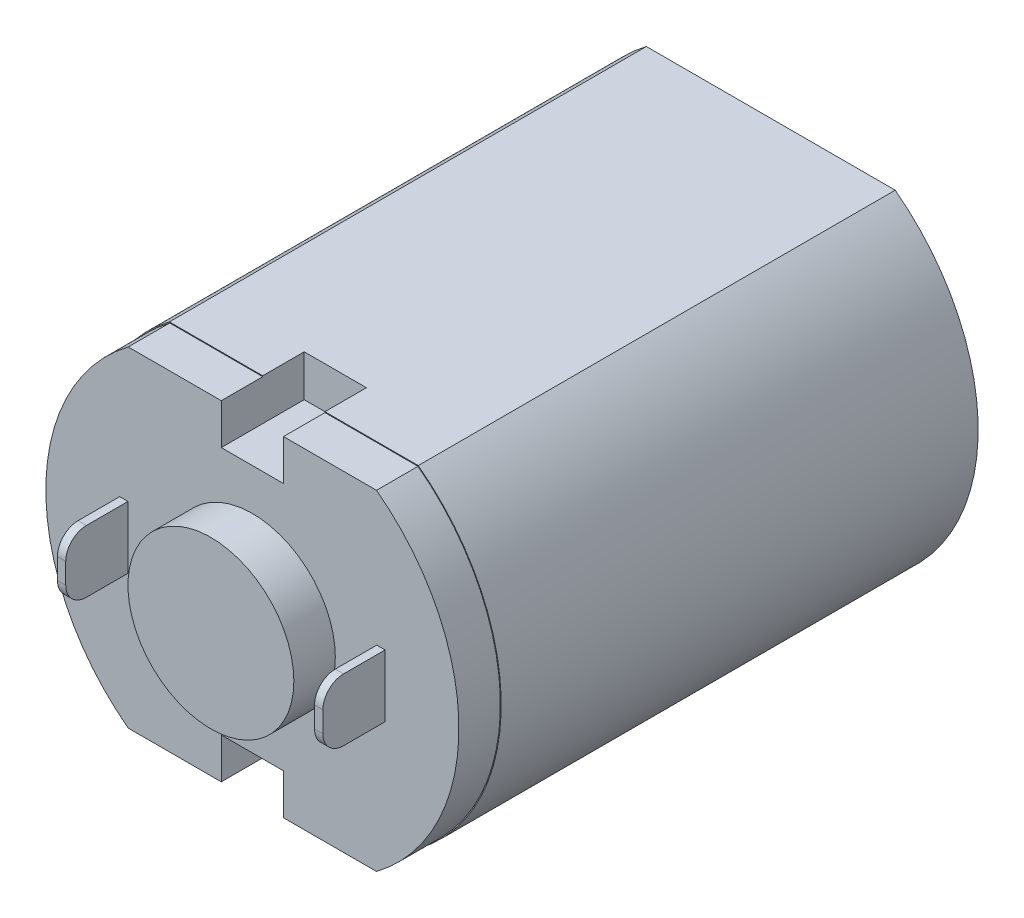
ISO-10303-21;
HEADER;
FILE_DESCRIPTION(('STEP AP214'),'2;1');
FILE_NAME('part.step','',(''),(''),'','','');
FILE_SCHEMA(('AUTOMOTIVE_DESIGN { 1 0 10303 214 1 1 1 1 }'));
ENDSEC;
DATA;
#1=APPLICATION_CONTEXT('core data for automotive mechanical design processes');
#2=APPLICATION_PROTOCOL_DEFINITION('international standard','automotive_design',2000,#1);
#3=PRODUCT_CONTEXT('',#1,'mechanical');
#4=PRODUCT('Part','Part','',(#3));
#5=PRODUCT_RELATED_PRODUCT_CATEGORY('part','',(#4));
#6=PRODUCT_DEFINITION_FORMATION('','',#4);
#7=PRODUCT_DEFINITION_CONTEXT('part definition',#1,'design');
#8=PRODUCT_DEFINITION('design','',#6,#7);
#9=PRODUCT_DEFINITION_SHAPE('','',#8);
#10=(LENGTH_UNIT() NAMED_UNIT(*) SI_UNIT(.MILLI.,.METRE.));
#11=(NAMED_UNIT(*) PLANE_ANGLE_UNIT() SI_UNIT($,.RADIAN.));
#12=(NAMED_UNIT(*) SI_UNIT($,.STERADIAN.) SOLID_ANGLE_UNIT());
#13=UNCERTAINTY_MEASURE_WITH_UNIT(LENGTH_MEASURE(1.E-05),#10,'distance_accuracy_value','');
#14=(GEOMETRIC_REPRESENTATION_CONTEXT(3) GLOBAL_UNCERTAINTY_ASSIGNED_CONTEXT((#13)) GLOBAL_UNIT_ASSIGNED_CONTEXT((#10,
#11,#12)) REPRESENTATION_CONTEXT('',''));
#15=CARTESIAN_POINT('',(0.,0.,0.));
#16=DIRECTION('',(0.,0.,1.));
#17=DIRECTION('',(1.,0.,0.));
#18=AXIS2_PLACEMENT_3D('',#15,#16,#17);
#19=CARTESIAN_POINT('',(-3.,4.,12.5));
#20=DIRECTION('',(0.,-1.,0.));
#21=DIRECTION('',(0.,0.,-1.));
#22=AXIS2_PLACEMENT_3D('',#19,#20,#21);
#23=PLANE('',#22);
#24=DIRECTION('',(1.,0.,0.));
#25=VECTOR('',#24,1.);
#26=CARTESIAN_POINT('',(0.,4.,11.5));
#27=LINE('',#26,#25);
#28=CARTESIAN_POINT('',(0.75,4.,11.5));
#29=VERTEX_POINT('',#28);
#30=CARTESIAN_POINT('',(3.,4.,11.5));
#31=VERTEX_POINT('',#30);
#32=EDGE_CURVE('E315',#29,#31,#27,.T.);
#33=ORIENTED_EDGE('',*,*,#32,.T.);
#34=DIRECTION('',(0.,0.,-1.));
#35=VECTOR('',#34,1.);
#36=CARTESIAN_POINT('',(3.,4.,12.5));
#37=LINE('',#36,#35);
#38=CARTESIAN_POINT('',(3.,4.,0.));
#39=VERTEX_POINT('',#38);
#40=EDGE_CURVE('E528',#31,#39,#37,.T.);
#41=ORIENTED_EDGE('',*,*,#40,.T.);
#42=DIRECTION('',(-1.,0.,0.));
#43=VECTOR('',#42,1.);
#44=CARTESIAN_POINT('',(-3.,4.,0.));
#45=LINE('',#44,#43);
#46=CARTESIAN_POINT('',(-3.,4.,0.));
#47=VERTEX_POINT('',#46);
#48=EDGE_CURVE('E507',#39,#47,#45,.T.);
#49=ORIENTED_EDGE('',*,*,#48,.T.);
#50=DIRECTION('',(0.,0.,-1.));
#51=VECTOR('',#50,1.);
#52=CARTESIAN_POINT('',(-3.,4.,12.5));
#53=LINE('',#52,#51);
#54=CARTESIAN_POINT('',(-3.,4.,11.5));
#55=VERTEX_POINT('',#54);
#56=EDGE_CURVE('E525',#55,#47,#53,.T.);
#57=ORIENTED_EDGE('',*,*,#56,.F.);
#58=CARTESIAN_POINT('',(-0.75,4.,11.5));
#59=VERTEX_POINT('',#58);
#60=EDGE_CURVE('E316',#55,#59,#27,.T.);
#61=ORIENTED_EDGE('',*,*,#60,.T.);
#62=DIRECTION('',(0.,0.,1.));
#63=VECTOR('',#62,1.);
#64=CARTESIAN_POINT('',(-0.75,4.,12.5));
#65=LINE('',#64,#63);
#66=CARTESIAN_POINT('',(-0.75,4.,10.5));
#67=VERTEX_POINT('',#66);
#68=EDGE_CURVE('E475',#67,#59,#65,.T.);
#69=ORIENTED_EDGE('',*,*,#68,.F.);
#70=DIRECTION('',(1.,0.,0.));
#71=VECTOR('',#70,1.);
#72=CARTESIAN_POINT('',(-3.,4.,10.5));
#73=LINE('',#72,#71);
#74=CARTESIAN_POINT('',(0.75,4.,10.5));
#75=VERTEX_POINT('',#74);
#76=EDGE_CURVE('E541',#67,#75,#73,.T.);
#77=ORIENTED_EDGE('',*,*,#76,.T.);
#78=DIRECTION('',(0.,0.,-1.));
#79=VECTOR('',#78,1.);
#80=CARTESIAN_POINT('',(0.75,4.,12.5));
#81=LINE('',#80,#79);
#82=EDGE_CURVE('E472',#29,#75,#81,.T.);
#83=ORIENTED_EDGE('',*,*,#82,.F.);
#84=EDGE_LOOP('',(#33,#41,#49,#57,#61,#69,#77,#83));
#85=FACE_BOUND('',#84,.T.);
#86=ADVANCED_FACE('F41',(#85),#23,.F.);
#87=CARTESIAN_POINT('',(-3.,-4.,12.5));
#88=DIRECTION('',(0.,1.,0.));
#89=DIRECTION('',(0.,0.,1.));
#90=AXIS2_PLACEMENT_3D('',#87,#88,#89);
#91=PLANE('',#90);
#92=DIRECTION('',(-1.,0.,0.));
#93=VECTOR('',#92,1.);
#94=CARTESIAN_POINT('',(0.,-4.,11.5));
#95=LINE('',#94,#93);
#96=CARTESIAN_POINT('',(-0.75,-4.,11.5));
#97=VERTEX_POINT('',#96);
#98=CARTESIAN_POINT('',(-3.,-4.,11.5));
#99=VERTEX_POINT('',#98);
#100=EDGE_CURVE('E269',#97,#99,#95,.T.);
#101=ORIENTED_EDGE('',*,*,#100,.T.);
#102=DIRECTION('',(0.,0.,-1.));
#103=VECTOR('',#102,1.);
#104=CARTESIAN_POINT('',(-3.,-4.,12.5));
#105=LINE('',#104,#103);
#106=CARTESIAN_POINT('',(-3.,-4.,0.));
#107=VERTEX_POINT('',#106);
#108=EDGE_CURVE('E522',#99,#107,#105,.T.);
#109=ORIENTED_EDGE('',*,*,#108,.T.);
#110=DIRECTION('',(1.,0.,0.));
#111=VECTOR('',#110,1.);
#112=CARTESIAN_POINT('',(-3.,-4.,0.));
#113=LINE('',#112,#111);
#114=CARTESIAN_POINT('',(3.,-4.,0.));
#115=VERTEX_POINT('',#114);
#116=EDGE_CURVE('E515',#107,#115,#113,.T.);
#117=ORIENTED_EDGE('',*,*,#116,.T.);
#118=DIRECTION('',(0.,0.,-1.));
#119=VECTOR('',#118,1.);
#120=CARTESIAN_POINT('',(3.,-4.,12.5));
#121=LINE('',#120,#119);
#122=CARTESIAN_POINT('',(3.,-4.,11.5));
#123=VERTEX_POINT('',#122);
#124=EDGE_CURVE('E519',#123,#115,#121,.T.);
#125=ORIENTED_EDGE('',*,*,#124,.F.);
#126=CARTESIAN_POINT('',(0.75,-4.,11.5));
#127=VERTEX_POINT('',#126);
#128=EDGE_CURVE('E308',#123,#127,#95,.T.);
#129=ORIENTED_EDGE('',*,*,#128,.T.);
#130=DIRECTION('',(0.,0.,1.));
#131=VECTOR('',#130,1.);
#132=CARTESIAN_POINT('',(0.75,-4.,12.5));
#133=LINE('',#132,#131);
#134=CARTESIAN_POINT('',(0.75,-4.,10.5));
#135=VERTEX_POINT('',#134);
#136=EDGE_CURVE('E468',#135,#127,#133,.T.);
#137=ORIENTED_EDGE('',*,*,#136,.F.);
#138=DIRECTION('',(-1.,0.,0.));
#139=VECTOR('',#138,1.);
#140=CARTESIAN_POINT('',(-3.,-4.,10.5));
#141=LINE('',#140,#139);
#142=CARTESIAN_POINT('',(-0.75,-4.,10.5));
#143=VERTEX_POINT('',#142);
#144=EDGE_CURVE('E537',#135,#143,#141,.T.);
#145=ORIENTED_EDGE('',*,*,#144,.T.);
#146=DIRECTION('',(0.,0.,-1.));
#147=VECTOR('',#146,1.);
#148=CARTESIAN_POINT('',(-0.75,-4.,12.5));
#149=LINE('',#148,#147);
#150=EDGE_CURVE('E441',#97,#143,#149,.T.);
#151=ORIENTED_EDGE('',*,*,#150,.F.);
#152=EDGE_LOOP('',(#101,#109,#117,#125,#129,#137,#145,#151));
#153=FACE_BOUND('',#152,.T.);
#154=ADVANCED_FACE('F652',(#153),#91,.F.);
#155=CARTESIAN_POINT('',(0.,0.,12.5));
#156=DIRECTION('',(0.,0.,-1.));
#157=DIRECTION('',(-1.,0.,0.));
#158=AXIS2_PLACEMENT_3D('',#155,#156,#157);
#159=CYLINDRICAL_SURFACE('',#158,5.);
#160=CARTESIAN_POINT('',(0.,0.,11.5));
#161=DIRECTION('',(0.,0.,1.));
#162=DIRECTION('',(1.,0.,0.));
#163=AXIS2_PLACEMENT_3D('',#160,#161,#162);
#164=CIRCLE('',#163,5.);
#165=EDGE_CURVE('E320',#123,#31,#164,.T.);
#166=ORIENTED_EDGE('',*,*,#165,.F.);
#167=ORIENTED_EDGE('',*,*,#124,.T.);
#168=CARTESIAN_POINT('',(0.,0.,0.));
#169=DIRECTION('',(0.,0.,1.));
#170=DIRECTION('',(1.,0.,0.));
#171=AXIS2_PLACEMENT_3D('',#168,#169,#170);
#172=CIRCLE('',#171,5.);
#173=EDGE_CURVE('E500',#115,#39,#172,.T.);
#174=ORIENTED_EDGE('',*,*,#173,.T.);
#175=ORIENTED_EDGE('',*,*,#40,.F.);
#176=EDGE_LOOP('',(#166,#167,#174,#175));
#177=FACE_BOUND('',#176,.T.);
#178=ADVANCED_FACE('F676',(#177),#159,.T.);
#179=CARTESIAN_POINT('',(0.,0.,12.5));
#180=DIRECTION('',(0.,0.,-1.));
#181=DIRECTION('',(-1.,0.,0.));
#182=AXIS2_PLACEMENT_3D('',#179,#180,#181);
#183=CYLINDRICAL_SURFACE('',#182,5.);
#184=CARTESIAN_POINT('',(0.,0.,11.5));
#185=DIRECTION('',(0.,0.,1.));
#186=DIRECTION('',(1.,0.,0.));
#187=AXIS2_PLACEMENT_3D('',#184,#185,#186);
#188=CIRCLE('',#187,5.);
#189=EDGE_CURVE('E312',#55,#99,#188,.T.);
#190=ORIENTED_EDGE('',*,*,#189,.F.);
#191=ORIENTED_EDGE('',*,*,#56,.T.);
#192=CARTESIAN_POINT('',(0.,0.,0.));
#193=DIRECTION('',(0.,0.,1.));
#194=DIRECTION('',(1.,0.,0.));
#195=AXIS2_PLACEMENT_3D('',#192,#193,#194);
#196=CIRCLE('',#195,5.);
#197=EDGE_CURVE('E511',#47,#107,#196,.T.);
#198=ORIENTED_EDGE('',*,*,#197,.T.);
#199=ORIENTED_EDGE('',*,*,#108,.F.);
#200=EDGE_LOOP('',(#190,#191,#198,#199));
#201=FACE_BOUND('',#200,.T.);
#202=ADVANCED_FACE('F646',(#201),#183,.T.);
#203=CARTESIAN_POINT('',(0.750000000000001,0.,10.5));
#204=DIRECTION('',(-1.,0.,0.));
#205=DIRECTION('',(0.,-1.,0.));
#206=AXIS2_PLACEMENT_3D('',#203,#204,#205);
#207=PLANE('',#206);
#208=ORIENTED_EDGE('',*,*,#136,.T.);
#209=DIRECTION('',(0.,1.,0.));
#210=VECTOR('',#209,1.);
#211=CARTESIAN_POINT('',(0.750000000000001,0.,11.5));
#212=LINE('',#211,#210);
#213=CARTESIAN_POINT('',(0.75,-3.98,11.5));
#214=VERTEX_POINT('',#213);
#215=EDGE_CURVE('E334',#127,#214,#212,.T.);
#216=ORIENTED_EDGE('',*,*,#215,.T.);
#217=DIRECTION('',(0.,0.,-1.));
#218=VECTOR('',#217,1.);
#219=CARTESIAN_POINT('',(0.75,-3.98,10.5));
#220=LINE('',#219,#218);
#221=CARTESIAN_POINT('',(0.75,-3.98,12.5));
#222=VERTEX_POINT('',#221);
#223=EDGE_CURVE('E338',#222,#214,#220,.T.);
#224=ORIENTED_EDGE('',*,*,#223,.F.);
#225=DIRECTION('',(0.,-1.,0.));
#226=VECTOR('',#225,1.);
#227=CARTESIAN_POINT('',(0.750000000000001,0.,12.5));
#228=LINE('',#227,#226);
#229=CARTESIAN_POINT('',(0.75,-3.,12.5));
#230=VERTEX_POINT('',#229);
#231=EDGE_CURVE('E405',#230,#222,#228,.T.);
#232=ORIENTED_EDGE('',*,*,#231,.F.);
#233=DIRECTION('',(0.,0.,1.));
#234=VECTOR('',#233,1.);
#235=CARTESIAN_POINT('',(0.75,-3.,10.5));
#236=LINE('',#235,#234);
#237=CARTESIAN_POINT('',(0.75,-3.,10.5));
#238=VERTEX_POINT('',#237);
#239=EDGE_CURVE('E453',#238,#230,#236,.T.);
#240=ORIENTED_EDGE('',*,*,#239,.F.);
#241=DIRECTION('',(0.,-1.,0.));
#242=VECTOR('',#241,1.);
#243=CARTESIAN_POINT('',(0.750000000000001,0.,10.5));
#244=LINE('',#243,#242);
#245=EDGE_CURVE('E442',#238,#135,#244,.T.);
#246=ORIENTED_EDGE('',*,*,#245,.T.);
#247=EDGE_LOOP('',(#208,#216,#224,#232,#240,#246));
#248=FACE_BOUND('',#247,.T.);
#249=ADVANCED_FACE('F669',(#248),#207,.T.);
#250=CARTESIAN_POINT('',(-0.749999999999999,0.,10.5));
#251=DIRECTION('',(1.,0.,0.));
#252=DIRECTION('',(0.,1.,0.));
#253=AXIS2_PLACEMENT_3D('',#250,#251,#252);
#254=PLANE('',#253);
#255=DIRECTION('',(0.,0.,1.));
#256=VECTOR('',#255,1.);
#257=CARTESIAN_POINT('',(-0.75,-3.98,10.5));
#258=LINE('',#257,#256);
#259=CARTESIAN_POINT('',(-0.75,-3.98,11.5));
#260=VERTEX_POINT('',#259);
#261=CARTESIAN_POINT('',(-0.75,-3.98,12.5));
#262=VERTEX_POINT('',#261);
#263=EDGE_CURVE('E11',#260,#262,#258,.T.);
#264=ORIENTED_EDGE('',*,*,#263,.F.);
#265=DIRECTION('',(0.,-1.,0.));
#266=VECTOR('',#265,1.);
#267=CARTESIAN_POINT('',(-0.749999999999999,0.,11.5));
#268=LINE('',#267,#266);
#269=EDGE_CURVE('E330',#260,#97,#268,.T.);
#270=ORIENTED_EDGE('',*,*,#269,.T.);
#271=ORIENTED_EDGE('',*,*,#150,.T.);
#272=DIRECTION('',(0.,1.,0.));
#273=VECTOR('',#272,1.);
#274=CARTESIAN_POINT('',(-0.749999999999999,0.,10.5));
#275=LINE('',#274,#273);
#276=CARTESIAN_POINT('',(-0.75,-3.,10.5));
#277=VERTEX_POINT('',#276);
#278=EDGE_CURVE('E446',#143,#277,#275,.T.);
#279=ORIENTED_EDGE('',*,*,#278,.T.);
#280=DIRECTION('',(0.,0.,1.));
#281=VECTOR('',#280,1.);
#282=CARTESIAN_POINT('',(-0.75,-3.,10.5));
#283=LINE('',#282,#281);
#284=CARTESIAN_POINT('',(-0.75,-3.,12.5));
#285=VERTEX_POINT('',#284);
#286=EDGE_CURVE('E430',#277,#285,#283,.T.);
#287=ORIENTED_EDGE('',*,*,#286,.T.);
#288=DIRECTION('',(0.,1.,0.));
#289=VECTOR('',#288,1.);
#290=CARTESIAN_POINT('',(-0.749999999999999,0.,12.5));
#291=LINE('',#290,#289);
#292=EDGE_CURVE('E531',#262,#285,#291,.T.);
#293=ORIENTED_EDGE('',*,*,#292,.F.);
#294=EDGE_LOOP('',(#264,#270,#271,#279,#287,#293));
#295=FACE_BOUND('',#294,.T.);
#296=ADVANCED_FACE('F658',(#295),#254,.T.);
#297=CARTESIAN_POINT('',(-0.749999999999999,0.,10.5));
#298=DIRECTION('',(1.,0.,0.));
#299=DIRECTION('',(0.,1.,0.));
#300=AXIS2_PLACEMENT_3D('',#297,#298,#299);
#301=PLANE('',#300);
#302=ORIENTED_EDGE('',*,*,#68,.T.);
#303=DIRECTION('',(0.,-1.,0.));
#304=VECTOR('',#303,1.);
#305=CARTESIAN_POINT('',(-0.749999999999999,0.,11.5));
#306=LINE('',#305,#304);
#307=CARTESIAN_POINT('',(-0.75,3.98,11.5));
#308=VERTEX_POINT('',#307);
#309=EDGE_CURVE('E326',#59,#308,#306,.T.);
#310=ORIENTED_EDGE('',*,*,#309,.T.);
#311=DIRECTION('',(0.,0.,-1.));
#312=VECTOR('',#311,1.);
#313=CARTESIAN_POINT('',(-0.75,3.98,10.5));
#314=LINE('',#313,#312);
#315=CARTESIAN_POINT('',(-0.75,3.98,12.5));
#316=VERTEX_POINT('',#315);
#317=EDGE_CURVE('E323',#316,#308,#314,.T.);
#318=ORIENTED_EDGE('',*,*,#317,.F.);
#319=DIRECTION('',(0.,1.,0.));
#320=VECTOR('',#319,1.);
#321=CARTESIAN_POINT('',(-0.749999999999999,0.,12.5));
#322=LINE('',#321,#320);
#323=CARTESIAN_POINT('',(-0.75,3.,12.5));
#324=VERTEX_POINT('',#323);
#325=EDGE_CURVE('E426',#324,#316,#322,.T.);
#326=ORIENTED_EDGE('',*,*,#325,.F.);
#327=DIRECTION('',(0.,0.,1.));
#328=VECTOR('',#327,1.);
#329=CARTESIAN_POINT('',(-0.75,3.,10.5));
#330=LINE('',#329,#328);
#331=CARTESIAN_POINT('',(-0.75,3.,10.5));
#332=VERTEX_POINT('',#331);
#333=EDGE_CURVE('E425',#332,#324,#330,.T.);
#334=ORIENTED_EDGE('',*,*,#333,.F.);
#335=DIRECTION('',(0.,1.,0.));
#336=VECTOR('',#335,1.);
#337=CARTESIAN_POINT('',(-0.749999999999999,0.,10.5));
#338=LINE('',#337,#336);
#339=EDGE_CURVE('E414',#332,#67,#338,.T.);
#340=ORIENTED_EDGE('',*,*,#339,.T.);
#341=EDGE_LOOP('',(#302,#310,#318,#326,#334,#340));
#342=FACE_BOUND('',#341,.T.);
#343=ADVANCED_FACE('F615',(#342),#301,.T.);
#344=CARTESIAN_POINT('',(0.750000000000001,0.,10.5));
#345=DIRECTION('',(-1.,0.,0.));
#346=DIRECTION('',(0.,-1.,0.));
#347=AXIS2_PLACEMENT_3D('',#344,#345,#346);
#348=PLANE('',#347);
#349=DIRECTION('',(0.,0.,1.));
#350=VECTOR('',#349,1.);
#351=CARTESIAN_POINT('',(0.75,3.98,10.5));
#352=LINE('',#351,#350);
#353=CARTESIAN_POINT('',(0.75,3.98,11.5));
#354=VERTEX_POINT('',#353);
#355=CARTESIAN_POINT('',(0.75,3.98,12.5));
#356=VERTEX_POINT('',#355);
#357=EDGE_CURVE('E597',#354,#356,#352,.T.);
#358=ORIENTED_EDGE('',*,*,#357,.F.);
#359=DIRECTION('',(0.,1.,0.));
#360=VECTOR('',#359,1.);
#361=CARTESIAN_POINT('',(0.750000000000001,0.,11.5));
#362=LINE('',#361,#360);
#363=EDGE_CURVE('E50',#354,#29,#362,.T.);
#364=ORIENTED_EDGE('',*,*,#363,.T.);
#365=ORIENTED_EDGE('',*,*,#82,.T.);
#366=DIRECTION('',(0.,-1.,0.));
#367=VECTOR('',#366,1.);
#368=CARTESIAN_POINT('',(0.750000000000001,0.,10.5));
#369=LINE('',#368,#367);
#370=CARTESIAN_POINT('',(0.75,3.,10.5));
#371=VERTEX_POINT('',#370);
#372=EDGE_CURVE('E418',#75,#371,#369,.T.);
#373=ORIENTED_EDGE('',*,*,#372,.T.);
#374=DIRECTION('',(0.,0.,1.));
#375=VECTOR('',#374,1.);
#376=CARTESIAN_POINT('',(0.75,3.,10.5));
#377=LINE('',#376,#375);
#378=CARTESIAN_POINT('',(0.75,3.,12.5));
#379=VERTEX_POINT('',#378);
#380=EDGE_CURVE('E437',#371,#379,#377,.T.);
#381=ORIENTED_EDGE('',*,*,#380,.T.);
#382=DIRECTION('',(0.,-1.,0.));
#383=VECTOR('',#382,1.);
#384=CARTESIAN_POINT('',(0.750000000000001,0.,12.5));
#385=LINE('',#384,#383);
#386=EDGE_CURVE('E534',#356,#379,#385,.T.);
#387=ORIENTED_EDGE('',*,*,#386,.F.);
#388=EDGE_LOOP('',(#358,#364,#365,#373,#381,#387));
#389=FACE_BOUND('',#388,.T.);
#390=ADVANCED_FACE('F602',(#389),#348,.T.);
#391=CARTESIAN_POINT('',(0.,0.,12.5));
#392=DIRECTION('',(0.,0.,1.));
#393=DIRECTION('',(1.,0.,0.));
#394=AXIS2_PLACEMENT_3D('',#391,#392,#393);
#395=PLANE('',#394);
#396=DIRECTION('',(1.,0.,0.));
#397=VECTOR('',#396,1.);
#398=CARTESIAN_POINT('',(0.,3.98,12.5));
#399=LINE('',#398,#397);
#400=CARTESIAN_POINT('',(2.99332590941915,3.98,12.5));
#401=VERTEX_POINT('',#400);
#402=EDGE_CURVE('E264',#356,#401,#399,.T.);
#403=ORIENTED_EDGE('',*,*,#402,.F.);
#404=ORIENTED_EDGE('',*,*,#386,.T.);
#405=DIRECTION('',(-1.,0.,0.));
#406=VECTOR('',#405,1.);
#407=CARTESIAN_POINT('',(0.,3.,12.5));
#408=LINE('',#407,#406);
#409=EDGE_CURVE('E419',#379,#324,#408,.T.);
#410=ORIENTED_EDGE('',*,*,#409,.T.);
#411=ORIENTED_EDGE('',*,*,#325,.T.);
#412=CARTESIAN_POINT('',(-2.99332590941915,3.98,12.5));
#413=VERTEX_POINT('',#412);
#414=EDGE_CURVE('E57',#413,#316,#399,.T.);
#415=ORIENTED_EDGE('',*,*,#414,.F.);
#416=CARTESIAN_POINT('',(0.,0.,12.5));
#417=DIRECTION('',(0.,0.,1.));
#418=DIRECTION('',(1.,0.,0.));
#419=AXIS2_PLACEMENT_3D('',#416,#417,#418);
#420=CIRCLE('',#419,4.98);
#421=CARTESIAN_POINT('',(-2.99332590941915,-3.98,12.5));
#422=VERTEX_POINT('',#421);
#423=EDGE_CURVE('E258',#413,#422,#420,.T.);
#424=ORIENTED_EDGE('',*,*,#423,.T.);
#425=DIRECTION('',(-1.,0.,0.));
#426=VECTOR('',#425,1.);
#427=CARTESIAN_POINT('',(0.,-3.98,12.5));
#428=LINE('',#427,#426);
#429=EDGE_CURVE('E293',#262,#422,#428,.T.);
#430=ORIENTED_EDGE('',*,*,#429,.F.);
#431=ORIENTED_EDGE('',*,*,#292,.T.);
#432=DIRECTION('',(1.,0.,0.));
#433=VECTOR('',#432,1.);
#434=CARTESIAN_POINT('',(0.,-3.,12.5));
#435=LINE('',#434,#433);
#436=EDGE_CURVE('E447',#285,#230,#435,.T.);
#437=ORIENTED_EDGE('',*,*,#436,.T.);
#438=ORIENTED_EDGE('',*,*,#231,.T.);
#439=CARTESIAN_POINT('',(2.99332590941915,-3.98,12.5));
#440=VERTEX_POINT('',#439);
#441=EDGE_CURVE('E294',#440,#222,#428,.T.);
#442=ORIENTED_EDGE('',*,*,#441,.F.);
#443=CARTESIAN_POINT('',(0.,0.,12.5));
#444=DIRECTION('',(0.,0.,1.));
#445=DIRECTION('',(1.,0.,0.));
#446=AXIS2_PLACEMENT_3D('',#443,#444,#445);
#447=CIRCLE('',#446,4.98);
#448=EDGE_CURVE('E290',#440,#401,#447,.T.);
#449=ORIENTED_EDGE('',*,*,#448,.T.);
#450=EDGE_LOOP('',(#403,#404,#410,#411,#415,#424,#430,#431,#437,#438,#442,#449));
#451=FACE_BOUND('',#450,.T.);
#452=DIRECTION('',(0.,1.,0.));
#453=VECTOR('',#452,1.);
#454=CARTESIAN_POINT('',(-3.2,0.,12.5));
#455=LINE('',#454,#453);
#456=CARTESIAN_POINT('',(-3.2,-0.749999999999999,12.5));
#457=VERTEX_POINT('',#456);
#458=CARTESIAN_POINT('',(-3.2,0.750000000000001,12.5));
#459=VERTEX_POINT('',#458);
#460=EDGE_CURVE('E341',#457,#459,#455,.T.);
#461=ORIENTED_EDGE('',*,*,#460,.T.);
#462=DIRECTION('',(1.,0.,0.));
#463=VECTOR('',#462,1.);
#464=CARTESIAN_POINT('',(0.,0.750000000000001,12.5));
#465=LINE('',#464,#463);
#466=CARTESIAN_POINT('',(-3.,0.750000000000001,12.5));
#467=VERTEX_POINT('',#466);
#468=EDGE_CURVE('E355',#459,#467,#465,.T.);
#469=ORIENTED_EDGE('',*,*,#468,.T.);
#470=DIRECTION('',(0.,-1.,0.));
#471=VECTOR('',#470,1.);
#472=CARTESIAN_POINT('',(-3.,0.,12.5));
#473=LINE('',#472,#471);
#474=CARTESIAN_POINT('',(-3.,-0.749999999999999,12.5));
#475=VERTEX_POINT('',#474);
#476=EDGE_CURVE('E359',#467,#475,#473,.T.);
#477=ORIENTED_EDGE('',*,*,#476,.T.);
#478=DIRECTION('',(-1.,0.,0.));
#479=VECTOR('',#478,1.);
#480=CARTESIAN_POINT('',(0.,-0.749999999999999,12.5));
#481=LINE('',#480,#479);
#482=EDGE_CURVE('E347',#475,#457,#481,.T.);
#483=ORIENTED_EDGE('',*,*,#482,.T.);
#484=EDGE_LOOP('',(#461,#469,#477,#483));
#485=FACE_BOUND('',#484,.T.);
#486=DIRECTION('',(0.,1.,0.));
#487=VECTOR('',#486,1.);
#488=CARTESIAN_POINT('',(3.,0.,12.5));
#489=LINE('',#488,#487);
#490=CARTESIAN_POINT('',(3.,-0.749999999999999,12.5));
#491=VERTEX_POINT('',#490);
#492=CARTESIAN_POINT('',(3.,0.750000000000001,12.5));
#493=VERTEX_POINT('',#492);
#494=EDGE_CURVE('E369',#491,#493,#489,.T.);
#495=ORIENTED_EDGE('',*,*,#494,.T.);
#496=DIRECTION('',(1.,0.,0.));
#497=VECTOR('',#496,1.);
#498=CARTESIAN_POINT('',(0.,0.750000000000001,12.5));
#499=LINE('',#498,#497);
#500=CARTESIAN_POINT('',(3.2,0.750000000000001,12.5));
#501=VERTEX_POINT('',#500);
#502=EDGE_CURVE('E391',#493,#501,#499,.T.);
#503=ORIENTED_EDGE('',*,*,#502,.T.);
#504=DIRECTION('',(0.,-1.,0.));
#505=VECTOR('',#504,1.);
#506=CARTESIAN_POINT('',(3.2,0.,12.5));
#507=LINE('',#506,#505);
#508=CARTESIAN_POINT('',(3.2,-0.749999999999999,12.5));
#509=VERTEX_POINT('',#508);
#510=EDGE_CURVE('E395',#501,#509,#507,.T.);
#511=ORIENTED_EDGE('',*,*,#510,.T.);
#512=DIRECTION('',(-1.,0.,0.));
#513=VECTOR('',#512,1.);
#514=CARTESIAN_POINT('',(0.,-0.749999999999999,12.5));
#515=LINE('',#514,#513);
#516=EDGE_CURVE('E383',#509,#491,#515,.T.);
#517=ORIENTED_EDGE('',*,*,#516,.T.);
#518=EDGE_LOOP('',(#495,#503,#511,#517));
#519=FACE_BOUND('',#518,.T.);
#520=CARTESIAN_POINT('',(0.,0.,12.5));
#521=DIRECTION('',(0.,0.,1.));
#522=DIRECTION('',(1.,0.,0.));
#523=AXIS2_PLACEMENT_3D('',#520,#521,#522);
#524=CIRCLE('',#523,2.);
#525=CARTESIAN_POINT('',(2.,0.,12.5));
#526=VERTEX_POINT('',#525);
#527=EDGE_CURVE('E483',#526,#526,#524,.F.);
#528=ORIENTED_EDGE('',*,*,#527,.T.);
#529=EDGE_LOOP('',(#528));
#530=FACE_BOUND('',#529,.T.);
#531=ADVANCED_FACE('F621',(#451,#485,#519,#530),#395,.T.);
#532=CARTESIAN_POINT('',(0.,0.,0.));
#533=DIRECTION('',(0.,0.,1.));
#534=DIRECTION('',(1.,0.,0.));
#535=AXIS2_PLACEMENT_3D('',#532,#533,#534);
#536=PLANE('',#535);
#537=CARTESIAN_POINT('',(0.,0.,0.));
#538=DIRECTION('',(0.,0.,1.));
#539=DIRECTION('',(1.,0.,0.));
#540=AXIS2_PLACEMENT_3D('',#537,#538,#539);
#541=CIRCLE('',#540,2.);
#542=CARTESIAN_POINT('',(2.,0.,0.));
#543=VERTEX_POINT('',#542);
#544=EDGE_CURVE('E495',#543,#543,#541,.T.);
#545=ORIENTED_EDGE('',*,*,#544,.T.);
#546=EDGE_LOOP('',(#545));
#547=FACE_BOUND('',#546,.T.);
#548=ORIENTED_EDGE('',*,*,#173,.F.);
#549=ORIENTED_EDGE('',*,*,#116,.F.);
#550=ORIENTED_EDGE('',*,*,#197,.F.);
#551=ORIENTED_EDGE('',*,*,#48,.F.);
#552=EDGE_LOOP('',(#548,#549,#550,#551));
#553=FACE_BOUND('',#552,.T.);
#554=ADVANCED_FACE('F679',(#547,#553),#536,.F.);
#555=CARTESIAN_POINT('',(0.,0.,-0.5));
#556=DIRECTION('',(0.,0.,1.));
#557=DIRECTION('',(1.,0.,0.));
#558=AXIS2_PLACEMENT_3D('',#555,#556,#557);
#559=CYLINDRICAL_SURFACE('',#558,2.);
#560=CARTESIAN_POINT('',(0.,0.,-0.5));
#561=DIRECTION('',(0.,0.,1.));
#562=DIRECTION('',(1.,0.,0.));
#563=AXIS2_PLACEMENT_3D('',#560,#561,#562);
#564=CIRCLE('',#563,2.);
#565=CARTESIAN_POINT('',(2.,0.,-0.5));
#566=VERTEX_POINT('',#565);
#567=EDGE_CURVE('E496',#566,#566,#564,.T.);
#568=ORIENTED_EDGE('',*,*,#567,.T.);
#569=EDGE_LOOP('',(#568));
#570=FACE_BOUND('',#569,.T.);
#571=ORIENTED_EDGE('',*,*,#544,.F.);
#572=EDGE_LOOP('',(#571));
#573=FACE_BOUND('',#572,.T.);
#574=ADVANCED_FACE('F681',(#570,#573),#559,.T.);
#575=CARTESIAN_POINT('',(0.,0.,-0.5));
#576=DIRECTION('',(0.,0.,1.));
#577=DIRECTION('',(1.,0.,0.));
#578=AXIS2_PLACEMENT_3D('',#575,#576,#577);
#579=PLANE('',#578);
#580=CARTESIAN_POINT('',(0.,0.,-0.5));
#581=DIRECTION('',(0.,0.,1.));
#582=DIRECTION('',(1.,0.,0.));
#583=AXIS2_PLACEMENT_3D('',#580,#581,#582);
#584=CIRCLE('',#583,0.5);
#585=CARTESIAN_POINT('',(0.5,0.,-0.5));
#586=VERTEX_POINT('',#585);
#587=EDGE_CURVE('E491',#586,#586,#584,.T.);
#588=ORIENTED_EDGE('',*,*,#587,.T.);
#589=EDGE_LOOP('',(#588));
#590=FACE_BOUND('',#589,.T.);
#591=ORIENTED_EDGE('',*,*,#567,.F.);
#592=EDGE_LOOP('',(#591));
#593=FACE_BOUND('',#592,.T.);
#594=ADVANCED_FACE('F688',(#590,#593),#579,.F.);
#595=CARTESIAN_POINT('',(0.,0.,-3.));
#596=DIRECTION('',(0.,0.,1.));
#597=DIRECTION('',(1.,0.,0.));
#598=AXIS2_PLACEMENT_3D('',#595,#596,#597);
#599=CYLINDRICAL_SURFACE('',#598,0.5);
#600=CARTESIAN_POINT('',(0.,0.,-3.));
#601=DIRECTION('',(0.,0.,1.));
#602=DIRECTION('',(1.,0.,0.));
#603=AXIS2_PLACEMENT_3D('',#600,#601,#602);
#604=CIRCLE('',#603,0.5);
#605=CARTESIAN_POINT('',(0.5,0.,-3.));
#606=VERTEX_POINT('',#605);
#607=EDGE_CURVE('E487',#606,#606,#604,.T.);
#608=ORIENTED_EDGE('',*,*,#607,.T.);
#609=EDGE_LOOP('',(#608));
#610=FACE_BOUND('',#609,.T.);
#611=ORIENTED_EDGE('',*,*,#587,.F.);
#612=EDGE_LOOP('',(#611));
#613=FACE_BOUND('',#612,.T.);
#614=ADVANCED_FACE('F805',(#610,#613),#599,.T.);
#615=CARTESIAN_POINT('',(0.,0.,-3.));
#616=DIRECTION('',(0.,0.,1.));
#617=DIRECTION('',(1.,0.,0.));
#618=AXIS2_PLACEMENT_3D('',#615,#616,#617);
#619=PLANE('',#618);
#620=ORIENTED_EDGE('',*,*,#607,.F.);
#621=EDGE_LOOP('',(#620));
#622=FACE_BOUND('',#621,.T.);
#623=ADVANCED_FACE('F801',(#622),#619,.F.);
#624=CARTESIAN_POINT('',(0.,0.,13.5));
#625=DIRECTION('',(0.,0.,-1.));
#626=DIRECTION('',(-1.,0.,0.));
#627=AXIS2_PLACEMENT_3D('',#624,#625,#626);
#628=CYLINDRICAL_SURFACE('',#627,2.);
#629=ORIENTED_EDGE('',*,*,#527,.F.);
#630=EDGE_LOOP('',(#629));
#631=FACE_BOUND('',#630,.T.);
#632=CARTESIAN_POINT('',(0.,0.,13.5));
#633=DIRECTION('',(0.,0.,1.));
#634=DIRECTION('',(1.,0.,0.));
#635=AXIS2_PLACEMENT_3D('',#632,#633,#634);
#636=CIRCLE('',#635,2.);
#637=CARTESIAN_POINT('',(2.,0.,13.5));
#638=VERTEX_POINT('',#637);
#639=EDGE_CURVE('E479',#638,#638,#636,.T.);
#640=ORIENTED_EDGE('',*,*,#639,.F.);
#641=EDGE_LOOP('',(#640));
#642=FACE_BOUND('',#641,.T.);
#643=ADVANCED_FACE('F797',(#631,#642),#628,.T.);
#644=CARTESIAN_POINT('',(0.,0.,13.5));
#645=DIRECTION('',(0.,0.,1.));
#646=DIRECTION('',(1.,0.,0.));
#647=AXIS2_PLACEMENT_3D('',#644,#645,#646);
#648=PLANE('',#647);
#649=ORIENTED_EDGE('',*,*,#639,.T.);
#650=EDGE_LOOP('',(#649));
#651=FACE_BOUND('',#650,.T.);
#652=ADVANCED_FACE('F788',(#651),#648,.T.);
#653=CARTESIAN_POINT('',(0.,0.,10.5));
#654=DIRECTION('',(0.,0.,-1.));
#655=DIRECTION('',(-1.,0.,0.));
#656=AXIS2_PLACEMENT_3D('',#653,#654,#655);
#657=PLANE('',#656);
#658=ORIENTED_EDGE('',*,*,#245,.F.);
#659=DIRECTION('',(1.,0.,0.));
#660=VECTOR('',#659,1.);
#661=CARTESIAN_POINT('',(0.,-3.,10.5));
#662=LINE('',#661,#660);
#663=EDGE_CURVE('E450',#277,#238,#662,.T.);
#664=ORIENTED_EDGE('',*,*,#663,.F.);
#665=ORIENTED_EDGE('',*,*,#278,.F.);
#666=ORIENTED_EDGE('',*,*,#144,.F.);
#667=EDGE_LOOP('',(#658,#664,#665,#666));
#668=FACE_BOUND('',#667,.T.);
#669=ADVANCED_FACE('F663',(#668),#657,.F.);
#670=CARTESIAN_POINT('',(0.,-3.,10.5));
#671=DIRECTION('',(0.,-1.,0.));
#672=DIRECTION('',(0.,0.,-1.));
#673=AXIS2_PLACEMENT_3D('',#670,#671,#672);
#674=PLANE('',#673);
#675=ORIENTED_EDGE('',*,*,#436,.F.);
#676=ORIENTED_EDGE('',*,*,#286,.F.);
#677=ORIENTED_EDGE('',*,*,#663,.T.);
#678=ORIENTED_EDGE('',*,*,#239,.T.);
#679=EDGE_LOOP('',(#675,#676,#677,#678));
#680=FACE_BOUND('',#679,.T.);
#681=ADVANCED_FACE('F667',(#680),#674,.T.);
#682=CARTESIAN_POINT('',(0.,0.,10.5));
#683=DIRECTION('',(0.,0.,-1.));
#684=DIRECTION('',(-1.,0.,0.));
#685=AXIS2_PLACEMENT_3D('',#682,#683,#684);
#686=PLANE('',#685);
#687=ORIENTED_EDGE('',*,*,#339,.F.);
#688=DIRECTION('',(-1.,0.,0.));
#689=VECTOR('',#688,1.);
#690=CARTESIAN_POINT('',(0.,3.,10.5));
#691=LINE('',#690,#689);
#692=EDGE_CURVE('E422',#371,#332,#691,.T.);
#693=ORIENTED_EDGE('',*,*,#692,.F.);
#694=ORIENTED_EDGE('',*,*,#372,.F.);
#695=ORIENTED_EDGE('',*,*,#76,.F.);
#696=EDGE_LOOP('',(#687,#693,#694,#695));
#697=FACE_BOUND('',#696,.T.);
#698=ADVANCED_FACE('F611',(#697),#686,.F.);
#699=CARTESIAN_POINT('',(0.,3.,10.5));
#700=DIRECTION('',(0.,1.,0.));
#701=DIRECTION('',(0.,0.,1.));
#702=AXIS2_PLACEMENT_3D('',#699,#700,#701);
#703=PLANE('',#702);
#704=ORIENTED_EDGE('',*,*,#409,.F.);
#705=ORIENTED_EDGE('',*,*,#380,.F.);
#706=ORIENTED_EDGE('',*,*,#692,.T.);
#707=ORIENTED_EDGE('',*,*,#333,.T.);
#708=EDGE_LOOP('',(#704,#705,#706,#707));
#709=FACE_BOUND('',#708,.T.);
#710=ADVANCED_FACE('F618',(#709),#703,.T.);
#711=CARTESIAN_POINT('',(3.,0.,14.));
#712=DIRECTION('',(-1.,0.,0.));
#713=DIRECTION('',(0.,0.,1.));
#714=AXIS2_PLACEMENT_3D('',#711,#712,#713);
#715=PLANE('',#714);
#716=DIRECTION('',(0.,1.,0.));
#717=VECTOR('',#716,1.);
#718=CARTESIAN_POINT('',(3.,0.,14.));
#719=LINE('',#718,#717);
#720=CARTESIAN_POINT('',(3.,-0.249999999999999,14.));
#721=VERTEX_POINT('',#720);
#722=CARTESIAN_POINT('',(3.,0.250000000000001,14.));
#723=VERTEX_POINT('',#722);
#724=EDGE_CURVE('E378',#721,#723,#719,.T.);
#725=ORIENTED_EDGE('',*,*,#724,.T.);
#726=CARTESIAN_POINT('',(3.,0.250000000000001,13.5));
#727=DIRECTION('',(-1.,0.,0.));
#728=DIRECTION('',(0.,0.,1.));
#729=AXIS2_PLACEMENT_3D('',#726,#727,#728);
#730=CIRCLE('',#729,0.5);
#731=CARTESIAN_POINT('',(3.,0.750000000000001,13.5));
#732=VERTEX_POINT('',#731);
#733=EDGE_CURVE('E564',#723,#732,#730,.T.);
#734=ORIENTED_EDGE('',*,*,#733,.T.);
#735=DIRECTION('',(0.,0.,-1.));
#736=VECTOR('',#735,1.);
#737=CARTESIAN_POINT('',(3.,0.750000000000001,14.));
#738=LINE('',#737,#736);
#739=EDGE_CURVE('E387',#732,#493,#738,.T.);
#740=ORIENTED_EDGE('',*,*,#739,.T.);
#741=ORIENTED_EDGE('',*,*,#494,.F.);
#742=DIRECTION('',(0.,0.,-1.));
#743=VECTOR('',#742,1.);
#744=CARTESIAN_POINT('',(3.,-0.749999999999999,14.));
#745=LINE('',#744,#743);
#746=CARTESIAN_POINT('',(3.,-0.749999999999999,13.5));
#747=VERTEX_POINT('',#746);
#748=EDGE_CURVE('E402',#747,#491,#745,.T.);
#749=ORIENTED_EDGE('',*,*,#748,.F.);
#750=CARTESIAN_POINT('',(3.,-0.249999999999999,13.5));
#751=DIRECTION('',(-1.,0.,0.));
#752=DIRECTION('',(0.,0.,1.));
#753=AXIS2_PLACEMENT_3D('',#750,#751,#752);
#754=CIRCLE('',#753,0.5);
#755=EDGE_CURVE('E561',#747,#721,#754,.T.);
#756=ORIENTED_EDGE('',*,*,#755,.T.);
#757=EDGE_LOOP('',(#725,#734,#740,#741,#749,#756));
#758=FACE_BOUND('',#757,.T.);
#759=ADVANCED_FACE('F767',(#758),#715,.T.);
#760=CARTESIAN_POINT('',(0.,-0.749999999999999,14.));
#761=DIRECTION('',(0.,-1.,0.));
#762=DIRECTION('',(0.,0.,-1.));
#763=AXIS2_PLACEMENT_3D('',#760,#761,#762);
#764=PLANE('',#763);
#765=DIRECTION('',(0.,0.,-1.));
#766=VECTOR('',#765,1.);
#767=CARTESIAN_POINT('',(3.2,-0.749999999999999,14.));
#768=LINE('',#767,#766);
#769=CARTESIAN_POINT('',(3.2,-0.749999999999999,13.5));
#770=VERTEX_POINT('',#769);
#771=EDGE_CURVE('E406',#770,#509,#768,.T.);
#772=ORIENTED_EDGE('',*,*,#771,.F.);
#773=DIRECTION('',(-1.,0.,0.));
#774=VECTOR('',#773,1.);
#775=CARTESIAN_POINT('',(3.,-0.749999999999999,13.5));
#776=LINE('',#775,#774);
#777=EDGE_CURVE('E567',#770,#747,#776,.T.);
#778=ORIENTED_EDGE('',*,*,#777,.T.);
#779=ORIENTED_EDGE('',*,*,#748,.T.);
#780=ORIENTED_EDGE('',*,*,#516,.F.);
#781=EDGE_LOOP('',(#772,#778,#779,#780));
#782=FACE_BOUND('',#781,.T.);
#783=ADVANCED_FACE('F763',(#782),#764,.T.);
#784=CARTESIAN_POINT('',(3.2,0.,14.));
#785=DIRECTION('',(1.,0.,0.));
#786=DIRECTION('',(0.,1.,0.));
#787=AXIS2_PLACEMENT_3D('',#784,#785,#786);
#788=PLANE('',#787);
#789=DIRECTION('',(0.,0.,-1.));
#790=VECTOR('',#789,1.);
#791=CARTESIAN_POINT('',(3.2,0.750000000000001,14.));
#792=LINE('',#791,#790);
#793=CARTESIAN_POINT('',(3.2,0.750000000000001,13.5));
#794=VERTEX_POINT('',#793);
#795=EDGE_CURVE('E409',#794,#501,#792,.T.);
#796=ORIENTED_EDGE('',*,*,#795,.F.);
#797=CARTESIAN_POINT('',(3.2,0.250000000000001,13.5));
#798=DIRECTION('',(1.,0.,0.));
#799=DIRECTION('',(0.,1.,0.));
#800=AXIS2_PLACEMENT_3D('',#797,#798,#799);
#801=CIRCLE('',#800,0.5);
#802=CARTESIAN_POINT('',(3.2,0.250000000000001,14.));
#803=VERTEX_POINT('',#802);
#804=EDGE_CURVE('E552',#794,#803,#801,.T.);
#805=ORIENTED_EDGE('',*,*,#804,.T.);
#806=DIRECTION('',(0.,-1.,0.));
#807=VECTOR('',#806,1.);
#808=CARTESIAN_POINT('',(3.2,0.,14.));
#809=LINE('',#808,#807);
#810=CARTESIAN_POINT('',(3.2,-0.249999999999999,14.));
#811=VERTEX_POINT('',#810);
#812=EDGE_CURVE('E382',#803,#811,#809,.T.);
#813=ORIENTED_EDGE('',*,*,#812,.T.);
#814=CARTESIAN_POINT('',(3.2,-0.249999999999999,13.5));
#815=DIRECTION('',(1.,0.,0.));
#816=DIRECTION('',(0.,1.,0.));
#817=AXIS2_PLACEMENT_3D('',#814,#815,#816);
#818=CIRCLE('',#817,0.5);
#819=EDGE_CURVE('E549',#811,#770,#818,.T.);
#820=ORIENTED_EDGE('',*,*,#819,.T.);
#821=ORIENTED_EDGE('',*,*,#771,.T.);
#822=ORIENTED_EDGE('',*,*,#510,.F.);
#823=EDGE_LOOP('',(#796,#805,#813,#820,#821,#822));
#824=FACE_BOUND('',#823,.T.);
#825=ADVANCED_FACE('F766',(#824),#788,.T.);
#826=CARTESIAN_POINT('',(0.,0.750000000000001,14.));
#827=DIRECTION('',(0.,1.,0.));
#828=DIRECTION('',(0.,0.,1.));
#829=AXIS2_PLACEMENT_3D('',#826,#827,#828);
#830=PLANE('',#829);
#831=ORIENTED_EDGE('',*,*,#739,.F.);
#832=DIRECTION('',(1.,0.,0.));
#833=VECTOR('',#832,1.);
#834=CARTESIAN_POINT('',(3.2,0.750000000000001,13.5));
#835=LINE('',#834,#833);
#836=EDGE_CURVE('E545',#732,#794,#835,.T.);
#837=ORIENTED_EDGE('',*,*,#836,.T.);
#838=ORIENTED_EDGE('',*,*,#795,.T.);
#839=ORIENTED_EDGE('',*,*,#502,.F.);
#840=EDGE_LOOP('',(#831,#837,#838,#839));
#841=FACE_BOUND('',#840,.T.);
#842=ADVANCED_FACE('F761',(#841),#830,.T.);
#843=CARTESIAN_POINT('',(0.,0.,14.));
#844=DIRECTION('',(0.,0.,-1.));
#845=DIRECTION('',(-1.,0.,0.));
#846=AXIS2_PLACEMENT_3D('',#843,#844,#845);
#847=PLANE('',#846);
#848=ORIENTED_EDGE('',*,*,#812,.F.);
#849=DIRECTION('',(1.,0.,0.));
#850=VECTOR('',#849,1.);
#851=CARTESIAN_POINT('',(3.,0.250000000000001,14.));
#852=LINE('',#851,#850);
#853=EDGE_CURVE('E558',#803,#723,#852,.F.);
#854=ORIENTED_EDGE('',*,*,#853,.T.);
#855=ORIENTED_EDGE('',*,*,#724,.F.);
#856=DIRECTION('',(-1.,0.,0.));
#857=VECTOR('',#856,1.);
#858=CARTESIAN_POINT('',(3.2,-0.249999999999999,14.));
#859=LINE('',#858,#857);
#860=EDGE_CURVE('E555',#721,#811,#859,.F.);
#861=ORIENTED_EDGE('',*,*,#860,.T.);
#862=EDGE_LOOP('',(#848,#854,#855,#861));
#863=FACE_BOUND('',#862,.T.);
#864=ADVANCED_FACE('F758',(#863),#847,.F.);
#865=CARTESIAN_POINT('',(-3.2,0.,14.));
#866=DIRECTION('',(-1.,0.,0.));
#867=DIRECTION('',(0.,-1.,0.));
#868=AXIS2_PLACEMENT_3D('',#865,#866,#867);
#869=PLANE('',#868);
#870=DIRECTION('',(0.,1.,0.));
#871=VECTOR('',#870,1.);
#872=CARTESIAN_POINT('',(-3.2,0.,14.));
#873=LINE('',#872,#871);
#874=CARTESIAN_POINT('',(-3.2,-0.249999999999999,14.));
#875=VERTEX_POINT('',#874);
#876=CARTESIAN_POINT('',(-3.2,0.250000000000001,14.));
#877=VERTEX_POINT('',#876);
#878=EDGE_CURVE('E342',#875,#877,#873,.T.);
#879=ORIENTED_EDGE('',*,*,#878,.T.);
#880=CARTESIAN_POINT('',(-3.2,0.250000000000001,13.5));
#881=DIRECTION('',(-1.,0.,0.));
#882=DIRECTION('',(0.,-1.,0.));
#883=AXIS2_PLACEMENT_3D('',#880,#881,#882);
#884=CIRCLE('',#883,0.5);
#885=CARTESIAN_POINT('',(-3.2,0.750000000000001,13.5));
#886=VERTEX_POINT('',#885);
#887=EDGE_CURVE('E590',#877,#886,#884,.T.);
#888=ORIENTED_EDGE('',*,*,#887,.T.);
#889=DIRECTION('',(0.,0.,-1.));
#890=VECTOR('',#889,1.);
#891=CARTESIAN_POINT('',(-3.2,0.750000000000001,14.));
#892=LINE('',#891,#890);
#893=EDGE_CURVE('E351',#886,#459,#892,.T.);
#894=ORIENTED_EDGE('',*,*,#893,.T.);
#895=ORIENTED_EDGE('',*,*,#460,.F.);
#896=DIRECTION('',(0.,0.,-1.));
#897=VECTOR('',#896,1.);
#898=CARTESIAN_POINT('',(-3.2,-0.749999999999999,14.));
#899=LINE('',#898,#897);
#900=CARTESIAN_POINT('',(-3.2,-0.749999999999999,13.5));
#901=VERTEX_POINT('',#900);
#902=EDGE_CURVE('E366',#901,#457,#899,.T.);
#903=ORIENTED_EDGE('',*,*,#902,.F.);
#904=CARTESIAN_POINT('',(-3.2,-0.249999999999999,13.5));
#905=DIRECTION('',(-1.,0.,0.));
#906=DIRECTION('',(0.,-1.,0.));
#907=AXIS2_PLACEMENT_3D('',#904,#905,#906);
#908=CIRCLE('',#907,0.5);
#909=EDGE_CURVE('E587',#901,#875,#908,.T.);
#910=ORIENTED_EDGE('',*,*,#909,.T.);
#911=EDGE_LOOP('',(#879,#888,#894,#895,#903,#910));
#912=FACE_BOUND('',#911,.T.);
#913=ADVANCED_FACE('F722',(#912),#869,.T.);
#914=CARTESIAN_POINT('',(0.,-0.749999999999999,14.));
#915=DIRECTION('',(0.,-1.,0.));
#916=DIRECTION('',(0.,0.,-1.));
#917=AXIS2_PLACEMENT_3D('',#914,#915,#916);
#918=PLANE('',#917);
#919=DIRECTION('',(0.,0.,-1.));
#920=VECTOR('',#919,1.);
#921=CARTESIAN_POINT('',(-3.,-0.749999999999999,14.));
#922=LINE('',#921,#920);
#923=CARTESIAN_POINT('',(-3.,-0.749999999999999,13.5));
#924=VERTEX_POINT('',#923);
#925=EDGE_CURVE('E370',#924,#475,#922,.T.);
#926=ORIENTED_EDGE('',*,*,#925,.F.);
#927=DIRECTION('',(-1.,0.,0.));
#928=VECTOR('',#927,1.);
#929=CARTESIAN_POINT('',(-3.2,-0.749999999999999,13.5));
#930=LINE('',#929,#928);
#931=EDGE_CURVE('E593',#924,#901,#930,.T.);
#932=ORIENTED_EDGE('',*,*,#931,.T.);
#933=ORIENTED_EDGE('',*,*,#902,.T.);
#934=ORIENTED_EDGE('',*,*,#482,.F.);
#935=EDGE_LOOP('',(#926,#932,#933,#934));
#936=FACE_BOUND('',#935,.T.);
#937=ADVANCED_FACE('F738',(#936),#918,.T.);
#938=CARTESIAN_POINT('',(-3.,0.,14.));
#939=DIRECTION('',(1.,0.,0.));
#940=DIRECTION('',(0.,0.,-1.));
#941=AXIS2_PLACEMENT_3D('',#938,#939,#940);
#942=PLANE('',#941);
#943=DIRECTION('',(0.,0.,-1.));
#944=VECTOR('',#943,1.);
#945=CARTESIAN_POINT('',(-3.,0.750000000000001,14.));
#946=LINE('',#945,#944);
#947=CARTESIAN_POINT('',(-3.,0.750000000000001,13.5));
#948=VERTEX_POINT('',#947);
#949=EDGE_CURVE('E373',#948,#467,#946,.T.);
#950=ORIENTED_EDGE('',*,*,#949,.F.);
#951=CARTESIAN_POINT('',(-3.,0.250000000000001,13.5));
#952=DIRECTION('',(1.,0.,0.));
#953=DIRECTION('',(0.,0.,-1.));
#954=AXIS2_PLACEMENT_3D('',#951,#952,#953);
#955=CIRCLE('',#954,0.5);
#956=CARTESIAN_POINT('',(-3.,0.250000000000001,14.));
#957=VERTEX_POINT('',#956);
#958=EDGE_CURVE('E578',#948,#957,#955,.T.);
#959=ORIENTED_EDGE('',*,*,#958,.T.);
#960=DIRECTION('',(0.,-1.,0.));
#961=VECTOR('',#960,1.);
#962=CARTESIAN_POINT('',(-3.,0.,14.));
#963=LINE('',#962,#961);
#964=CARTESIAN_POINT('',(-3.,-0.249999999999999,14.));
#965=VERTEX_POINT('',#964);
#966=EDGE_CURVE('E346',#957,#965,#963,.T.);
#967=ORIENTED_EDGE('',*,*,#966,.T.);
#968=CARTESIAN_POINT('',(-3.,-0.249999999999999,13.5));
#969=DIRECTION('',(1.,0.,0.));
#970=DIRECTION('',(0.,0.,-1.));
#971=AXIS2_PLACEMENT_3D('',#968,#969,#970);
#972=CIRCLE('',#971,0.5);
#973=EDGE_CURVE('E575',#965,#924,#972,.T.);
#974=ORIENTED_EDGE('',*,*,#973,.T.);
#975=ORIENTED_EDGE('',*,*,#925,.T.);
#976=ORIENTED_EDGE('',*,*,#476,.F.);
#977=EDGE_LOOP('',(#950,#959,#967,#974,#975,#976));
#978=FACE_BOUND('',#977,.T.);
#979=ADVANCED_FACE('F733',(#978),#942,.T.);
#980=CARTESIAN_POINT('',(0.,0.750000000000001,14.));
#981=DIRECTION('',(0.,1.,0.));
#982=DIRECTION('',(0.,0.,1.));
#983=AXIS2_PLACEMENT_3D('',#980,#981,#982);
#984=PLANE('',#983);
#985=ORIENTED_EDGE('',*,*,#893,.F.);
#986=DIRECTION('',(1.,0.,0.));
#987=VECTOR('',#986,1.);
#988=CARTESIAN_POINT('',(-3.,0.750000000000001,13.5));
#989=LINE('',#988,#987);
#990=EDGE_CURVE('E571',#886,#948,#989,.T.);
#991=ORIENTED_EDGE('',*,*,#990,.T.);
#992=ORIENTED_EDGE('',*,*,#949,.T.);
#993=ORIENTED_EDGE('',*,*,#468,.F.);
#994=EDGE_LOOP('',(#985,#991,#992,#993));
#995=FACE_BOUND('',#994,.T.);
#996=ADVANCED_FACE('F727',(#995),#984,.T.);
#997=CARTESIAN_POINT('',(0.,0.,14.));
#998=DIRECTION('',(0.,0.,-1.));
#999=DIRECTION('',(-1.,0.,0.));
#1000=AXIS2_PLACEMENT_3D('',#997,#998,#999);
#1001=PLANE('',#1000);
#1002=ORIENTED_EDGE('',*,*,#966,.F.);
#1003=DIRECTION('',(1.,0.,0.));
#1004=VECTOR('',#1003,1.);
#1005=CARTESIAN_POINT('',(-3.2,0.250000000000001,14.));
#1006=LINE('',#1005,#1004);
#1007=EDGE_CURVE('E584',#957,#877,#1006,.F.);
#1008=ORIENTED_EDGE('',*,*,#1007,.T.);
#1009=ORIENTED_EDGE('',*,*,#878,.F.);
#1010=DIRECTION('',(-1.,0.,0.));
#1011=VECTOR('',#1010,1.);
#1012=CARTESIAN_POINT('',(-3.,-0.249999999999999,14.));
#1013=LINE('',#1012,#1011);
#1014=EDGE_CURVE('E581',#875,#965,#1013,.F.);
#1015=ORIENTED_EDGE('',*,*,#1014,.T.);
#1016=EDGE_LOOP('',(#1002,#1008,#1009,#1015));
#1017=FACE_BOUND('',#1016,.T.);
#1018=ADVANCED_FACE('F706',(#1017),#1001,.F.);
#1019=CARTESIAN_POINT('',(0.,0.250000000000001,13.5));
#1020=DIRECTION('',(-1.,0.,0.));
#1021=DIRECTION('',(0.,0.,1.));
#1022=AXIS2_PLACEMENT_3D('',#1019,#1020,#1021);
#1023=CYLINDRICAL_SURFACE('',#1022,0.5);
#1024=ORIENTED_EDGE('',*,*,#733,.F.);
#1025=ORIENTED_EDGE('',*,*,#853,.F.);
#1026=ORIENTED_EDGE('',*,*,#804,.F.);
#1027=ORIENTED_EDGE('',*,*,#836,.F.);
#1028=EDGE_LOOP('',(#1024,#1025,#1026,#1027));
#1029=FACE_BOUND('',#1028,.T.);
#1030=ADVANCED_FACE('F702',(#1029),#1023,.T.);
#1031=CARTESIAN_POINT('',(0.,-0.249999999999999,13.5));
#1032=DIRECTION('',(1.,0.,0.));
#1033=DIRECTION('',(0.,0.,-1.));
#1034=AXIS2_PLACEMENT_3D('',#1031,#1032,#1033);
#1035=CYLINDRICAL_SURFACE('',#1034,0.5);
#1036=ORIENTED_EDGE('',*,*,#819,.F.);
#1037=ORIENTED_EDGE('',*,*,#860,.F.);
#1038=ORIENTED_EDGE('',*,*,#755,.F.);
#1039=ORIENTED_EDGE('',*,*,#777,.F.);
#1040=EDGE_LOOP('',(#1036,#1037,#1038,#1039));
#1041=FACE_BOUND('',#1040,.T.);
#1042=ADVANCED_FACE('F705',(#1041),#1035,.T.);
#1043=CARTESIAN_POINT('',(0.,0.250000000000001,13.5));
#1044=DIRECTION('',(-1.,0.,0.));
#1045=DIRECTION('',(0.,0.,1.));
#1046=AXIS2_PLACEMENT_3D('',#1043,#1044,#1045);
#1047=CYLINDRICAL_SURFACE('',#1046,0.5);
#1048=ORIENTED_EDGE('',*,*,#887,.F.);
#1049=ORIENTED_EDGE('',*,*,#1007,.F.);
#1050=ORIENTED_EDGE('',*,*,#958,.F.);
#1051=ORIENTED_EDGE('',*,*,#990,.F.);
#1052=EDGE_LOOP('',(#1048,#1049,#1050,#1051));
#1053=FACE_BOUND('',#1052,.T.);
#1054=ADVANCED_FACE('F709',(#1053),#1047,.T.);
#1055=CARTESIAN_POINT('',(0.,-0.249999999999999,13.5));
#1056=DIRECTION('',(1.,0.,0.));
#1057=DIRECTION('',(0.,0.,-1.));
#1058=AXIS2_PLACEMENT_3D('',#1055,#1056,#1057);
#1059=CYLINDRICAL_SURFACE('',#1058,0.5);
#1060=ORIENTED_EDGE('',*,*,#973,.F.);
#1061=ORIENTED_EDGE('',*,*,#1014,.F.);
#1062=ORIENTED_EDGE('',*,*,#909,.F.);
#1063=ORIENTED_EDGE('',*,*,#931,.F.);
#1064=EDGE_LOOP('',(#1060,#1061,#1062,#1063));
#1065=FACE_BOUND('',#1064,.T.);
#1066=ADVANCED_FACE('F43',(#1065),#1059,.T.);
#1067=CARTESIAN_POINT('',(0.,3.98,11.5));
#1068=DIRECTION('',(0.,-1.,0.));
#1069=DIRECTION('',(0.,0.,-1.));
#1070=AXIS2_PLACEMENT_3D('',#1067,#1068,#1069);
#1071=PLANE('',#1070);
#1072=ORIENTED_EDGE('',*,*,#357,.T.);
#1073=ORIENTED_EDGE('',*,*,#402,.T.);
#1074=DIRECTION('',(0.,0.,1.));
#1075=VECTOR('',#1074,1.);
#1076=CARTESIAN_POINT('',(2.99332590941915,3.98,11.5));
#1077=LINE('',#1076,#1075);
#1078=CARTESIAN_POINT('',(2.99332590941915,3.98,11.5));
#1079=VERTEX_POINT('',#1078);
#1080=EDGE_CURVE('E261',#1079,#401,#1077,.T.);
#1081=ORIENTED_EDGE('',*,*,#1080,.F.);
#1082=DIRECTION('',(1.,0.,0.));
#1083=VECTOR('',#1082,1.);
#1084=CARTESIAN_POINT('',(0.,3.98,11.5));
#1085=LINE('',#1084,#1083);
#1086=EDGE_CURVE('E65',#354,#1079,#1085,.T.);
#1087=ORIENTED_EDGE('',*,*,#1086,.F.);
#1088=EDGE_LOOP('',(#1072,#1073,#1081,#1087));
#1089=FACE_BOUND('',#1088,.T.);
#1090=ADVANCED_FACE('F262',(#1089),#1071,.F.);
#1091=CARTESIAN_POINT('',(0.,0.,11.5));
#1092=DIRECTION('',(0.,0.,1.));
#1093=DIRECTION('',(1.,0.,0.));
#1094=AXIS2_PLACEMENT_3D('',#1091,#1092,#1093);
#1095=PLANE('',#1094);
#1096=ORIENTED_EDGE('',*,*,#128,.F.);
#1097=ORIENTED_EDGE('',*,*,#165,.T.);
#1098=ORIENTED_EDGE('',*,*,#32,.F.);
#1099=ORIENTED_EDGE('',*,*,#363,.F.);
#1100=ORIENTED_EDGE('',*,*,#1086,.T.);
#1101=CARTESIAN_POINT('',(0.,0.,11.5));
#1102=DIRECTION('',(0.,0.,1.));
#1103=DIRECTION('',(1.,0.,0.));
#1104=AXIS2_PLACEMENT_3D('',#1101,#1102,#1103);
#1105=CIRCLE('',#1104,4.98);
#1106=CARTESIAN_POINT('',(2.99332590941915,-3.98,11.5));
#1107=VERTEX_POINT('',#1106);
#1108=EDGE_CURVE('E252',#1107,#1079,#1105,.T.);
#1109=ORIENTED_EDGE('',*,*,#1108,.F.);
#1110=DIRECTION('',(-1.,0.,0.));
#1111=VECTOR('',#1110,1.);
#1112=CARTESIAN_POINT('',(0.,-3.98,11.5));
#1113=LINE('',#1112,#1111);
#1114=EDGE_CURVE('E278',#1107,#214,#1113,.T.);
#1115=ORIENTED_EDGE('',*,*,#1114,.T.);
#1116=ORIENTED_EDGE('',*,*,#215,.F.);
#1117=EDGE_LOOP('',(#1096,#1097,#1098,#1099,#1100,#1109,#1115,#1116));
#1118=FACE_BOUND('',#1117,.T.);
#1119=ADVANCED_FACE('F249',(#1118),#1095,.T.);
#1120=CARTESIAN_POINT('',(0.,-3.98,11.5));
#1121=DIRECTION('',(0.,1.,0.));
#1122=DIRECTION('',(0.,0.,1.));
#1123=AXIS2_PLACEMENT_3D('',#1120,#1121,#1122);
#1124=PLANE('',#1123);
#1125=ORIENTED_EDGE('',*,*,#223,.T.);
#1126=ORIENTED_EDGE('',*,*,#1114,.F.);
#1127=DIRECTION('',(0.,0.,1.));
#1128=VECTOR('',#1127,1.);
#1129=CARTESIAN_POINT('',(2.99332590941915,-3.98,11.5));
#1130=LINE('',#1129,#1128);
#1131=EDGE_CURVE('E270',#1107,#440,#1130,.T.);
#1132=ORIENTED_EDGE('',*,*,#1131,.T.);
#1133=ORIENTED_EDGE('',*,*,#441,.T.);
#1134=EDGE_LOOP('',(#1125,#1126,#1132,#1133));
#1135=FACE_BOUND('',#1134,.T.);
#1136=ADVANCED_FACE('F672',(#1135),#1124,.F.);
#1137=CARTESIAN_POINT('',(0.,0.,11.5));
#1138=DIRECTION('',(0.,0.,1.));
#1139=DIRECTION('',(1.,0.,0.));
#1140=AXIS2_PLACEMENT_3D('',#1137,#1138,#1139);
#1141=CYLINDRICAL_SURFACE('',#1140,4.98);
#1142=ORIENTED_EDGE('',*,*,#448,.F.);
#1143=ORIENTED_EDGE('',*,*,#1131,.F.);
#1144=ORIENTED_EDGE('',*,*,#1108,.T.);
#1145=ORIENTED_EDGE('',*,*,#1080,.T.);
#1146=EDGE_LOOP('',(#1142,#1143,#1144,#1145));
#1147=FACE_BOUND('',#1146,.T.);
#1148=ADVANCED_FACE('F272',(#1147),#1141,.T.);
#1149=ORIENTED_EDGE('',*,*,#317,.T.);
#1150=CARTESIAN_POINT('',(-2.99332590941915,3.98,11.5));
#1151=VERTEX_POINT('',#1150);
#1152=EDGE_CURVE('E257',#1151,#308,#1085,.T.);
#1153=ORIENTED_EDGE('',*,*,#1152,.F.);
#1154=DIRECTION('',(0.,0.,1.));
#1155=VECTOR('',#1154,1.);
#1156=CARTESIAN_POINT('',(-2.99332590941915,3.98,11.5));
#1157=LINE('',#1156,#1155);
#1158=EDGE_CURVE('E287',#1151,#413,#1157,.T.);
#1159=ORIENTED_EDGE('',*,*,#1158,.T.);
#1160=ORIENTED_EDGE('',*,*,#414,.T.);
#1161=EDGE_LOOP('',(#1149,#1153,#1159,#1160));
#1162=FACE_BOUND('',#1161,.T.);
#1163=ADVANCED_FACE('F640',(#1162),#1071,.F.);
#1164=CARTESIAN_POINT('',(-2.99332590941915,-3.98,11.5));
#1165=VERTEX_POINT('',#1164);
#1166=EDGE_CURVE('E274',#260,#1165,#1113,.T.);
#1167=ORIENTED_EDGE('',*,*,#1166,.T.);
#1168=CARTESIAN_POINT('',(0.,0.,11.5));
#1169=DIRECTION('',(0.,0.,1.));
#1170=DIRECTION('',(1.,0.,0.));
#1171=AXIS2_PLACEMENT_3D('',#1168,#1169,#1170);
#1172=CIRCLE('',#1171,4.98);
#1173=EDGE_CURVE('E283',#1151,#1165,#1172,.T.);
#1174=ORIENTED_EDGE('',*,*,#1173,.F.);
#1175=ORIENTED_EDGE('',*,*,#1152,.T.);
#1176=ORIENTED_EDGE('',*,*,#309,.F.);
#1177=ORIENTED_EDGE('',*,*,#60,.F.);
#1178=ORIENTED_EDGE('',*,*,#189,.T.);
#1179=ORIENTED_EDGE('',*,*,#100,.F.);
#1180=ORIENTED_EDGE('',*,*,#269,.F.);
#1181=EDGE_LOOP('',(#1167,#1174,#1175,#1176,#1177,#1178,#1179,#1180));
#1182=FACE_BOUND('',#1181,.T.);
#1183=ADVANCED_FACE('F639',(#1182),#1095,.T.);
#1184=ORIENTED_EDGE('',*,*,#263,.T.);
#1185=ORIENTED_EDGE('',*,*,#429,.T.);
#1186=DIRECTION('',(0.,0.,1.));
#1187=VECTOR('',#1186,1.);
#1188=CARTESIAN_POINT('',(-2.99332590941915,-3.98,11.5));
#1189=LINE('',#1188,#1187);
#1190=EDGE_CURVE('E302',#1165,#422,#1189,.T.);
#1191=ORIENTED_EDGE('',*,*,#1190,.F.);
#1192=ORIENTED_EDGE('',*,*,#1166,.F.);
#1193=EDGE_LOOP('',(#1184,#1185,#1191,#1192));
#1194=FACE_BOUND('',#1193,.T.);
#1195=ADVANCED_FACE('F629',(#1194),#1124,.F.);
#1196=CARTESIAN_POINT('',(0.,0.,11.5));
#1197=DIRECTION('',(0.,0.,1.));
#1198=DIRECTION('',(1.,0.,0.));
#1199=AXIS2_PLACEMENT_3D('',#1196,#1197,#1198);
#1200=CYLINDRICAL_SURFACE('',#1199,4.98);
#1201=ORIENTED_EDGE('',*,*,#423,.F.);
#1202=ORIENTED_EDGE('',*,*,#1158,.F.);
#1203=ORIENTED_EDGE('',*,*,#1173,.T.);
#1204=ORIENTED_EDGE('',*,*,#1190,.T.);
#1205=EDGE_LOOP('',(#1201,#1202,#1203,#1204));
#1206=FACE_BOUND('',#1205,.T.);
#1207=ADVANCED_FACE('F635',(#1206),#1200,.T.);
#1208=CLOSED_SHELL('',(#86,#154,#178,#202,#249,#296,#343,#390,#531,#554,#574,#594,#614,#623,
#643,#652,#669,#681,#698,#710,#759,#783,#825,#842,#864,#913,#937,#979,#996,#1018,#1030,#1042,
#1054,#1066,#1090,#1119,#1136,#1148,#1163,#1183,#1195,#1207));
#1209=MANIFOLD_SOLID_BREP('B2',#1208);
#1210=ADVANCED_BREP_SHAPE_REPRESENTATION('',(#18,#1209),#14);
#1211=SHAPE_DEFINITION_REPRESENTATION(#9,#1210);
ENDSEC;
END-ISO-10303-21;
